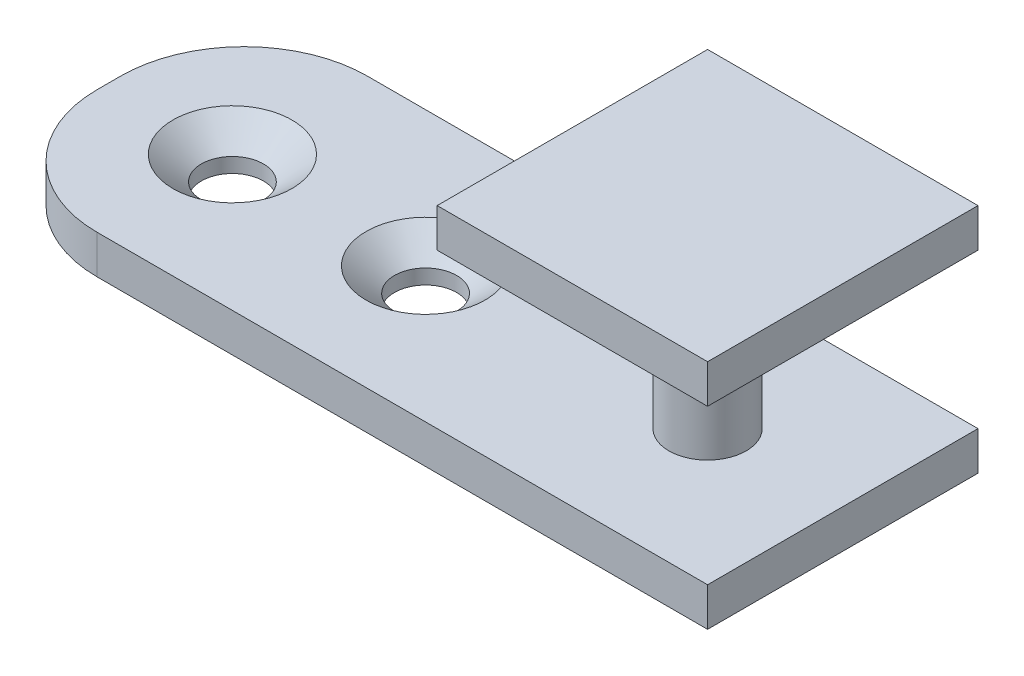
ISO-10303-21;
HEADER;
FILE_DESCRIPTION(('STEP AP214'),'2;1');
FILE_NAME('part.step','',(''),(''),'','','');
FILE_SCHEMA(('AUTOMOTIVE_DESIGN { 1 0 10303 214 1 1 1 1 }'));
ENDSEC;
DATA;
#1=APPLICATION_CONTEXT('core data for automotive mechanical design processes');
#2=APPLICATION_PROTOCOL_DEFINITION('international standard','automotive_design',2000,#1);
#3=PRODUCT_CONTEXT('',#1,'mechanical');
#4=PRODUCT('Part','Part','',(#3));
#5=PRODUCT_RELATED_PRODUCT_CATEGORY('part','',(#4));
#6=PRODUCT_DEFINITION_FORMATION('','',#4);
#7=PRODUCT_DEFINITION_CONTEXT('part definition',#1,'design');
#8=PRODUCT_DEFINITION('design','',#6,#7);
#9=PRODUCT_DEFINITION_SHAPE('','',#8);
#10=(LENGTH_UNIT() NAMED_UNIT(*) SI_UNIT(.MILLI.,.METRE.));
#11=(NAMED_UNIT(*) PLANE_ANGLE_UNIT() SI_UNIT($,.RADIAN.));
#12=(NAMED_UNIT(*) SI_UNIT($,.STERADIAN.) SOLID_ANGLE_UNIT());
#13=UNCERTAINTY_MEASURE_WITH_UNIT(LENGTH_MEASURE(1.E-05),#10,'distance_accuracy_value','');
#14=(GEOMETRIC_REPRESENTATION_CONTEXT(3) GLOBAL_UNCERTAINTY_ASSIGNED_CONTEXT((#13)) GLOBAL_UNIT_ASSIGNED_CONTEXT((#10,
#11,#12)) REPRESENTATION_CONTEXT('',''));
#15=CARTESIAN_POINT('',(0.,0.,0.));
#16=DIRECTION('',(0.,0.,1.));
#17=DIRECTION('',(1.,0.,0.));
#18=AXIS2_PLACEMENT_3D('',#15,#16,#17);
#19=CARTESIAN_POINT('',(0.,12.7,0.));
#20=DIRECTION('',(0.,-1.,0.));
#21=DIRECTION('',(0.,0.,-1.));
#22=AXIS2_PLACEMENT_3D('',#19,#20,#21);
#23=CYLINDRICAL_SURFACE('',#22,3.175);
#24=CARTESIAN_POINT('',(0.,12.7,0.));
#25=DIRECTION('',(0.,1.,0.));
#26=DIRECTION('',(0.,0.,1.));
#27=AXIS2_PLACEMENT_3D('',#24,#25,#26);
#28=CIRCLE('',#27,3.175);
#29=CARTESIAN_POINT('',(0.,12.7,3.175));
#30=VERTEX_POINT('',#29);
#31=EDGE_CURVE('E11',#30,#30,#28,.T.);
#32=ORIENTED_EDGE('',*,*,#31,.F.);
#33=EDGE_LOOP('',(#32));
#34=FACE_BOUND('',#33,.T.);
#35=CARTESIAN_POINT('',(0.,0.,0.));
#36=DIRECTION('',(0.,1.,0.));
#37=DIRECTION('',(0.,0.,1.));
#38=AXIS2_PLACEMENT_3D('',#35,#36,#37);
#39=CIRCLE('',#38,3.175);
#40=CARTESIAN_POINT('',(0.,0.,3.175));
#41=VERTEX_POINT('',#40);
#42=EDGE_CURVE('E36',#41,#41,#39,.T.);
#43=ORIENTED_EDGE('',*,*,#42,.T.);
#44=EDGE_LOOP('',(#43));
#45=FACE_BOUND('',#44,.T.);
#46=ADVANCED_FACE('F33',(#34,#45),#23,.T.);
#47=CARTESIAN_POINT('',(-11.1125,15.875,11.1125));
#48=DIRECTION('',(0.,0.,-1.));
#49=DIRECTION('',(-1.,0.,0.));
#50=AXIS2_PLACEMENT_3D('',#47,#48,#49);
#51=PLANE('',#50);
#52=DIRECTION('',(1.,0.,0.));
#53=VECTOR('',#52,1.);
#54=CARTESIAN_POINT('',(-11.1125,12.7,11.1125));
#55=LINE('',#54,#53);
#56=CARTESIAN_POINT('',(-11.1125,12.7,11.1125));
#57=VERTEX_POINT('',#56);
#58=CARTESIAN_POINT('',(11.1125,12.7,11.1125));
#59=VERTEX_POINT('',#58);
#60=EDGE_CURVE('E185',#57,#59,#55,.T.);
#61=ORIENTED_EDGE('',*,*,#60,.T.);
#62=DIRECTION('',(0.,-1.,0.));
#63=VECTOR('',#62,1.);
#64=CARTESIAN_POINT('',(11.1125,15.875,11.1125));
#65=LINE('',#64,#63);
#66=CARTESIAN_POINT('',(11.1125,15.875,11.1125));
#67=VERTEX_POINT('',#66);
#68=EDGE_CURVE('E42',#67,#59,#65,.T.);
#69=ORIENTED_EDGE('',*,*,#68,.F.);
#70=DIRECTION('',(1.,0.,0.));
#71=VECTOR('',#70,1.);
#72=CARTESIAN_POINT('',(-11.1125,15.875,11.1125));
#73=LINE('',#72,#71);
#74=CARTESIAN_POINT('',(-11.1125,15.875,11.1125));
#75=VERTEX_POINT('',#74);
#76=EDGE_CURVE('E176',#75,#67,#73,.T.);
#77=ORIENTED_EDGE('',*,*,#76,.F.);
#78=DIRECTION('',(0.,-1.,0.));
#79=VECTOR('',#78,1.);
#80=CARTESIAN_POINT('',(-11.1125,15.875,11.1125));
#81=LINE('',#80,#79);
#82=EDGE_CURVE('E50',#75,#57,#81,.T.);
#83=ORIENTED_EDGE('',*,*,#82,.T.);
#84=EDGE_LOOP('',(#61,#69,#77,#83));
#85=FACE_BOUND('',#84,.T.);
#86=ADVANCED_FACE('F201',(#85),#51,.F.);
#87=CARTESIAN_POINT('',(11.1125,15.875,11.1125));
#88=DIRECTION('',(-1.,0.,0.));
#89=DIRECTION('',(0.,0.,1.));
#90=AXIS2_PLACEMENT_3D('',#87,#88,#89);
#91=PLANE('',#90);
#92=DIRECTION('',(0.,0.,-1.));
#93=VECTOR('',#92,1.);
#94=CARTESIAN_POINT('',(11.1125,12.7,11.1125));
#95=LINE('',#94,#93);
#96=CARTESIAN_POINT('',(11.1125,12.7,-11.1125));
#97=VERTEX_POINT('',#96);
#98=EDGE_CURVE('E187',#59,#97,#95,.T.);
#99=ORIENTED_EDGE('',*,*,#98,.T.);
#100=DIRECTION('',(0.,-1.,0.));
#101=VECTOR('',#100,1.);
#102=CARTESIAN_POINT('',(11.1125,15.875,-11.1125));
#103=LINE('',#102,#101);
#104=CARTESIAN_POINT('',(11.1125,15.875,-11.1125));
#105=VERTEX_POINT('',#104);
#106=EDGE_CURVE('E197',#105,#97,#103,.T.);
#107=ORIENTED_EDGE('',*,*,#106,.F.);
#108=DIRECTION('',(0.,0.,-1.));
#109=VECTOR('',#108,1.);
#110=CARTESIAN_POINT('',(11.1125,15.875,11.1125));
#111=LINE('',#110,#109);
#112=EDGE_CURVE('E77',#67,#105,#111,.T.);
#113=ORIENTED_EDGE('',*,*,#112,.F.);
#114=ORIENTED_EDGE('',*,*,#68,.T.);
#115=EDGE_LOOP('',(#99,#107,#113,#114));
#116=FACE_BOUND('',#115,.T.);
#117=ADVANCED_FACE('F200',(#116),#91,.F.);
#118=CARTESIAN_POINT('',(-11.1125,15.875,-11.1125));
#119=DIRECTION('',(0.,0.,-1.));
#120=DIRECTION('',(-1.,0.,0.));
#121=AXIS2_PLACEMENT_3D('',#118,#119,#120);
#122=PLANE('',#121);
#123=DIRECTION('',(1.,0.,0.));
#124=VECTOR('',#123,1.);
#125=CARTESIAN_POINT('',(-11.1125,12.7,-11.1125));
#126=LINE('',#125,#124);
#127=CARTESIAN_POINT('',(-11.1125,12.7,-11.1125));
#128=VERTEX_POINT('',#127);
#129=EDGE_CURVE('E190',#128,#97,#126,.T.);
#130=ORIENTED_EDGE('',*,*,#129,.F.);
#131=DIRECTION('',(0.,-1.,0.));
#132=VECTOR('',#131,1.);
#133=CARTESIAN_POINT('',(-11.1125,15.875,-11.1125));
#134=LINE('',#133,#132);
#135=CARTESIAN_POINT('',(-11.1125,15.875,-11.1125));
#136=VERTEX_POINT('',#135);
#137=EDGE_CURVE('E65',#136,#128,#134,.T.);
#138=ORIENTED_EDGE('',*,*,#137,.F.);
#139=DIRECTION('',(1.,0.,0.));
#140=VECTOR('',#139,1.);
#141=CARTESIAN_POINT('',(-11.1125,15.875,-11.1125));
#142=LINE('',#141,#140);
#143=EDGE_CURVE('E180',#136,#105,#142,.T.);
#144=ORIENTED_EDGE('',*,*,#143,.T.);
#145=ORIENTED_EDGE('',*,*,#106,.T.);
#146=EDGE_LOOP('',(#130,#138,#144,#145));
#147=FACE_BOUND('',#146,.T.);
#148=ADVANCED_FACE('F207',(#147),#122,.T.);
#149=CARTESIAN_POINT('',(-11.1125,15.875,11.1125));
#150=DIRECTION('',(-1.,0.,0.));
#151=DIRECTION('',(0.,0.,1.));
#152=AXIS2_PLACEMENT_3D('',#149,#150,#151);
#153=PLANE('',#152);
#154=DIRECTION('',(0.,0.,-1.));
#155=VECTOR('',#154,1.);
#156=CARTESIAN_POINT('',(-11.1125,12.7,11.1125));
#157=LINE('',#156,#155);
#158=EDGE_CURVE('E178',#57,#128,#157,.T.);
#159=ORIENTED_EDGE('',*,*,#158,.F.);
#160=ORIENTED_EDGE('',*,*,#82,.F.);
#161=DIRECTION('',(0.,0.,-1.));
#162=VECTOR('',#161,1.);
#163=CARTESIAN_POINT('',(-11.1125,15.875,11.1125));
#164=LINE('',#163,#162);
#165=EDGE_CURVE('E183',#75,#136,#164,.T.);
#166=ORIENTED_EDGE('',*,*,#165,.T.);
#167=ORIENTED_EDGE('',*,*,#137,.T.);
#168=EDGE_LOOP('',(#159,#160,#166,#167));
#169=FACE_BOUND('',#168,.T.);
#170=ADVANCED_FACE('F204',(#169),#153,.T.);
#171=CARTESIAN_POINT('',(0.,15.875,0.));
#172=DIRECTION('',(0.,1.,0.));
#173=DIRECTION('',(0.,0.,1.));
#174=AXIS2_PLACEMENT_3D('',#171,#172,#173);
#175=PLANE('',#174);
#176=ORIENTED_EDGE('',*,*,#76,.T.);
#177=ORIENTED_EDGE('',*,*,#112,.T.);
#178=ORIENTED_EDGE('',*,*,#143,.F.);
#179=ORIENTED_EDGE('',*,*,#165,.F.);
#180=EDGE_LOOP('',(#176,#177,#178,#179));
#181=FACE_BOUND('',#180,.T.);
#182=ADVANCED_FACE('F206',(#181),#175,.T.);
#183=CARTESIAN_POINT('',(0.,12.7,0.));
#184=DIRECTION('',(0.,1.,0.));
#185=DIRECTION('',(0.,0.,1.));
#186=AXIS2_PLACEMENT_3D('',#183,#184,#185);
#187=PLANE('',#186);
#188=ORIENTED_EDGE('',*,*,#31,.T.);
#189=EDGE_LOOP('',(#188));
#190=FACE_BOUND('',#189,.T.);
#191=ORIENTED_EDGE('',*,*,#60,.F.);
#192=ORIENTED_EDGE('',*,*,#158,.T.);
#193=ORIENTED_EDGE('',*,*,#129,.T.);
#194=ORIENTED_EDGE('',*,*,#98,.F.);
#195=EDGE_LOOP('',(#191,#192,#193,#194));
#196=FACE_BOUND('',#195,.T.);
#197=ADVANCED_FACE('F203',(#190,#196),#187,.F.);
#198=CARTESIAN_POINT('',(-11.1125,-3.175,11.1125));
#199=DIRECTION('',(0.,0.,1.));
#200=DIRECTION('',(1.,0.,0.));
#201=AXIS2_PLACEMENT_3D('',#198,#199,#200);
#202=PLANE('',#201);
#203=DIRECTION('',(1.,0.,0.));
#204=VECTOR('',#203,1.);
#205=CARTESIAN_POINT('',(-11.1125,0.,11.1125));
#206=LINE('',#205,#204);
#207=CARTESIAN_POINT('',(-39.0525,0.,11.1125));
#208=VERTEX_POINT('',#207);
#209=CARTESIAN_POINT('',(11.1125,0.,11.1125));
#210=VERTEX_POINT('',#209);
#211=EDGE_CURVE('E134',#208,#210,#206,.T.);
#212=ORIENTED_EDGE('',*,*,#211,.F.);
#213=DIRECTION('',(0.,-1.,0.));
#214=VECTOR('',#213,1.);
#215=CARTESIAN_POINT('',(-39.0525,44.1085096665031,11.1125));
#216=LINE('',#215,#214);
#217=CARTESIAN_POINT('',(-39.0525,-3.175,11.1125));
#218=VERTEX_POINT('',#217);
#219=EDGE_CURVE('E131',#208,#218,#216,.T.);
#220=ORIENTED_EDGE('',*,*,#219,.T.);
#221=DIRECTION('',(1.,0.,0.));
#222=VECTOR('',#221,1.);
#223=CARTESIAN_POINT('',(-11.1125,-3.175,11.1125));
#224=LINE('',#223,#222);
#225=CARTESIAN_POINT('',(11.1125,-3.175,11.1125));
#226=VERTEX_POINT('',#225);
#227=EDGE_CURVE('E118',#218,#226,#224,.T.);
#228=ORIENTED_EDGE('',*,*,#227,.T.);
#229=DIRECTION('',(0.,1.,0.));
#230=VECTOR('',#229,1.);
#231=CARTESIAN_POINT('',(11.1125,-3.175,11.1125));
#232=LINE('',#231,#230);
#233=EDGE_CURVE('E166',#226,#210,#232,.T.);
#234=ORIENTED_EDGE('',*,*,#233,.T.);
#235=EDGE_LOOP('',(#212,#220,#228,#234));
#236=FACE_BOUND('',#235,.T.);
#237=ADVANCED_FACE('F132',(#236),#202,.T.);
#238=CARTESIAN_POINT('',(-11.1125,-3.175,-11.1125));
#239=DIRECTION('',(0.,0.,1.));
#240=DIRECTION('',(1.,0.,0.));
#241=AXIS2_PLACEMENT_3D('',#238,#239,#240);
#242=PLANE('',#241);
#243=DIRECTION('',(1.,0.,0.));
#244=VECTOR('',#243,1.);
#245=CARTESIAN_POINT('',(-11.1125,0.,-11.1125));
#246=LINE('',#245,#244);
#247=CARTESIAN_POINT('',(-39.0525,0.,-11.1125));
#248=VERTEX_POINT('',#247);
#249=CARTESIAN_POINT('',(11.1125,0.,-11.1125));
#250=VERTEX_POINT('',#249);
#251=EDGE_CURVE('E168',#248,#250,#246,.T.);
#252=ORIENTED_EDGE('',*,*,#251,.T.);
#253=DIRECTION('',(0.,1.,0.));
#254=VECTOR('',#253,1.);
#255=CARTESIAN_POINT('',(11.1125,-3.175,-11.1125));
#256=LINE('',#255,#254);
#257=CARTESIAN_POINT('',(11.1125,-3.175,-11.1125));
#258=VERTEX_POINT('',#257);
#259=EDGE_CURVE('E174',#258,#250,#256,.T.);
#260=ORIENTED_EDGE('',*,*,#259,.F.);
#261=DIRECTION('',(1.,0.,0.));
#262=VECTOR('',#261,1.);
#263=CARTESIAN_POINT('',(-11.1125,-3.175,-11.1125));
#264=LINE('',#263,#262);
#265=CARTESIAN_POINT('',(-39.0525,-3.175,-11.1125));
#266=VERTEX_POINT('',#265);
#267=EDGE_CURVE('E127',#266,#258,#264,.T.);
#268=ORIENTED_EDGE('',*,*,#267,.F.);
#269=DIRECTION('',(0.,-1.,0.));
#270=VECTOR('',#269,1.);
#271=CARTESIAN_POINT('',(-39.0525,44.1085096665031,-11.1125));
#272=LINE('',#271,#270);
#273=EDGE_CURVE('E157',#248,#266,#272,.T.);
#274=ORIENTED_EDGE('',*,*,#273,.F.);
#275=EDGE_LOOP('',(#252,#260,#268,#274));
#276=FACE_BOUND('',#275,.T.);
#277=ADVANCED_FACE('F240',(#276),#242,.F.);
#278=CARTESIAN_POINT('',(11.1125,-3.175,11.1125));
#279=DIRECTION('',(1.,0.,0.));
#280=DIRECTION('',(0.,0.,-1.));
#281=AXIS2_PLACEMENT_3D('',#278,#279,#280);
#282=PLANE('',#281);
#283=DIRECTION('',(0.,0.,-1.));
#284=VECTOR('',#283,1.);
#285=CARTESIAN_POINT('',(11.1125,0.,11.1125));
#286=LINE('',#285,#284);
#287=EDGE_CURVE('E128',#210,#250,#286,.T.);
#288=ORIENTED_EDGE('',*,*,#287,.F.);
#289=ORIENTED_EDGE('',*,*,#233,.F.);
#290=DIRECTION('',(0.,0.,-1.));
#291=VECTOR('',#290,1.);
#292=CARTESIAN_POINT('',(11.1125,-3.175,11.1125));
#293=LINE('',#292,#291);
#294=EDGE_CURVE('E125',#226,#258,#293,.T.);
#295=ORIENTED_EDGE('',*,*,#294,.T.);
#296=ORIENTED_EDGE('',*,*,#259,.T.);
#297=EDGE_LOOP('',(#288,#289,#295,#296));
#298=FACE_BOUND('',#297,.T.);
#299=ADVANCED_FACE('F236',(#298),#282,.T.);
#300=CARTESIAN_POINT('',(0.,-3.175,0.));
#301=DIRECTION('',(0.,-1.,0.));
#302=DIRECTION('',(0.,0.,1.));
#303=AXIS2_PLACEMENT_3D('',#300,#301,#302);
#304=PLANE('',#303);
#305=CARTESIAN_POINT('',(-39.0525,-3.175,0.));
#306=DIRECTION('',(0.,1.,0.));
#307=DIRECTION('',(0.,0.,1.));
#308=AXIS2_PLACEMENT_3D('',#305,#306,#307);
#309=CIRCLE('',#308,2.5527);
#310=CARTESIAN_POINT('',(-39.0525,-3.175,2.5527));
#311=VERTEX_POINT('',#310);
#312=EDGE_CURVE('E254',#311,#311,#309,.T.);
#313=ORIENTED_EDGE('',*,*,#312,.T.);
#314=EDGE_LOOP('',(#313));
#315=FACE_BOUND('',#314,.T.);
#316=CARTESIAN_POINT('',(-23.1775,-3.175,0.));
#317=DIRECTION('',(0.,1.,0.));
#318=DIRECTION('',(0.,0.,1.));
#319=AXIS2_PLACEMENT_3D('',#316,#317,#318);
#320=CIRCLE('',#319,2.5527);
#321=CARTESIAN_POINT('',(-23.1775,-3.175,2.5527));
#322=VERTEX_POINT('',#321);
#323=EDGE_CURVE('E145',#322,#322,#320,.T.);
#324=ORIENTED_EDGE('',*,*,#323,.T.);
#325=EDGE_LOOP('',(#324));
#326=FACE_BOUND('',#325,.T.);
#327=ORIENTED_EDGE('',*,*,#227,.F.);
#328=CARTESIAN_POINT('',(-39.0525,-3.175,0.952499999999997));
#329=DIRECTION('',(0.,-1.,0.));
#330=DIRECTION('',(0.,0.,1.));
#331=AXIS2_PLACEMENT_3D('',#328,#329,#330);
#332=CIRCLE('',#331,10.16);
#333=CARTESIAN_POINT('',(-49.2125,-3.175,0.952499999999997));
#334=VERTEX_POINT('',#333);
#335=EDGE_CURVE('E123',#218,#334,#332,.T.);
#336=ORIENTED_EDGE('',*,*,#335,.T.);
#337=DIRECTION('',(0.,0.,-1.));
#338=VECTOR('',#337,1.);
#339=CARTESIAN_POINT('',(-49.2125,-3.175,-0.9525));
#340=LINE('',#339,#338);
#341=CARTESIAN_POINT('',(-49.2125,-3.175,-0.952499999999998));
#342=VERTEX_POINT('',#341);
#343=EDGE_CURVE('E144',#334,#342,#340,.T.);
#344=ORIENTED_EDGE('',*,*,#343,.T.);
#345=CARTESIAN_POINT('',(-39.0525,-3.175,-0.9525));
#346=DIRECTION('',(0.,-1.,0.));
#347=DIRECTION('',(0.,0.,-1.));
#348=AXIS2_PLACEMENT_3D('',#345,#346,#347);
#349=CIRCLE('',#348,10.16);
#350=EDGE_CURVE('E139',#342,#266,#349,.T.);
#351=ORIENTED_EDGE('',*,*,#350,.T.);
#352=ORIENTED_EDGE('',*,*,#267,.T.);
#353=ORIENTED_EDGE('',*,*,#294,.F.);
#354=EDGE_LOOP('',(#327,#336,#344,#351,#352,#353));
#355=FACE_BOUND('',#354,.T.);
#356=ADVANCED_FACE('F120',(#315,#326,#355),#304,.T.);
#357=CARTESIAN_POINT('',(0.,0.,0.));
#358=DIRECTION('',(0.,-1.,0.));
#359=DIRECTION('',(0.,0.,1.));
#360=AXIS2_PLACEMENT_3D('',#357,#358,#359);
#361=PLANE('',#360);
#362=CARTESIAN_POINT('',(-39.0525,0.,0.));
#363=DIRECTION('',(0.,1.,0.));
#364=DIRECTION('',(0.,0.,1.));
#365=AXIS2_PLACEMENT_3D('',#362,#363,#364);
#366=CIRCLE('',#365,4.8895);
#367=CARTESIAN_POINT('',(-39.0525,0.,4.8895));
#368=VERTEX_POINT('',#367);
#369=EDGE_CURVE('E260',#368,#368,#366,.T.);
#370=ORIENTED_EDGE('',*,*,#369,.F.);
#371=EDGE_LOOP('',(#370));
#372=FACE_BOUND('',#371,.T.);
#373=CARTESIAN_POINT('',(-23.1775,0.,0.));
#374=DIRECTION('',(0.,1.,0.));
#375=DIRECTION('',(0.,0.,1.));
#376=AXIS2_PLACEMENT_3D('',#373,#374,#375);
#377=CIRCLE('',#376,4.8895);
#378=CARTESIAN_POINT('',(-23.1775,0.,4.8895));
#379=VERTEX_POINT('',#378);
#380=EDGE_CURVE('E251',#379,#379,#377,.T.);
#381=ORIENTED_EDGE('',*,*,#380,.F.);
#382=EDGE_LOOP('',(#381));
#383=FACE_BOUND('',#382,.T.);
#384=ORIENTED_EDGE('',*,*,#42,.F.);
#385=EDGE_LOOP('',(#384));
#386=FACE_BOUND('',#385,.T.);
#387=ORIENTED_EDGE('',*,*,#211,.T.);
#388=ORIENTED_EDGE('',*,*,#287,.T.);
#389=ORIENTED_EDGE('',*,*,#251,.F.);
#390=CARTESIAN_POINT('',(-39.0525,0.,-0.9525));
#391=DIRECTION('',(0.,-1.,0.));
#392=DIRECTION('',(0.,0.,-1.));
#393=AXIS2_PLACEMENT_3D('',#390,#391,#392);
#394=CIRCLE('',#393,10.16);
#395=CARTESIAN_POINT('',(-49.2125,0.,-0.952499999999998));
#396=VERTEX_POINT('',#395);
#397=EDGE_CURVE('E152',#248,#396,#394,.F.);
#398=ORIENTED_EDGE('',*,*,#397,.T.);
#399=DIRECTION('',(0.,0.,1.));
#400=VECTOR('',#399,1.);
#401=CARTESIAN_POINT('',(-49.2125,0.,-0.9525));
#402=LINE('',#401,#400);
#403=CARTESIAN_POINT('',(-49.2125,0.,0.952499999999997));
#404=VERTEX_POINT('',#403);
#405=EDGE_CURVE('E246',#396,#404,#402,.T.);
#406=ORIENTED_EDGE('',*,*,#405,.T.);
#407=CARTESIAN_POINT('',(-39.0525,0.,0.952499999999997));
#408=DIRECTION('',(0.,-1.,0.));
#409=DIRECTION('',(0.,0.,-1.));
#410=AXIS2_PLACEMENT_3D('',#407,#408,#409);
#411=CIRCLE('',#410,10.16);
#412=EDGE_CURVE('E160',#404,#208,#411,.F.);
#413=ORIENTED_EDGE('',*,*,#412,.T.);
#414=EDGE_LOOP('',(#387,#388,#389,#398,#406,#413));
#415=FACE_BOUND('',#414,.T.);
#416=ADVANCED_FACE('F228',(#372,#383,#386,#415),#361,.F.);
#417=CARTESIAN_POINT('',(-39.0525,44.1085096665031,-0.9525));
#418=DIRECTION('',(0.,-1.,0.));
#419=DIRECTION('',(0.,0.,-1.));
#420=AXIS2_PLACEMENT_3D('',#417,#418,#419);
#421=CYLINDRICAL_SURFACE('',#420,10.16);
#422=ORIENTED_EDGE('',*,*,#397,.F.);
#423=ORIENTED_EDGE('',*,*,#273,.T.);
#424=ORIENTED_EDGE('',*,*,#350,.F.);
#425=DIRECTION('',(0.,-1.,0.));
#426=VECTOR('',#425,1.);
#427=CARTESIAN_POINT('',(-49.2125,44.1085096665031,-0.952499999999998));
#428=LINE('',#427,#426);
#429=EDGE_CURVE('E161',#396,#342,#428,.T.);
#430=ORIENTED_EDGE('',*,*,#429,.F.);
#431=EDGE_LOOP('',(#422,#423,#424,#430));
#432=FACE_BOUND('',#431,.T.);
#433=ADVANCED_FACE('F231',(#432),#421,.T.);
#434=CARTESIAN_POINT('',(-49.2125,44.1085096665031,-0.9525));
#435=DIRECTION('',(-1.,0.,0.));
#436=DIRECTION('',(0.,0.,1.));
#437=AXIS2_PLACEMENT_3D('',#434,#435,#436);
#438=PLANE('',#437);
#439=ORIENTED_EDGE('',*,*,#405,.F.);
#440=ORIENTED_EDGE('',*,*,#429,.T.);
#441=ORIENTED_EDGE('',*,*,#343,.F.);
#442=DIRECTION('',(0.,-1.,0.));
#443=VECTOR('',#442,1.);
#444=CARTESIAN_POINT('',(-49.2125,44.1085096665031,0.952499999999997));
#445=LINE('',#444,#443);
#446=EDGE_CURVE('E138',#404,#334,#445,.T.);
#447=ORIENTED_EDGE('',*,*,#446,.F.);
#448=EDGE_LOOP('',(#439,#440,#441,#447));
#449=FACE_BOUND('',#448,.T.);
#450=ADVANCED_FACE('F287',(#449),#438,.T.);
#451=CARTESIAN_POINT('',(-39.0525,44.1085096665031,0.952499999999997));
#452=DIRECTION('',(0.,-1.,0.));
#453=DIRECTION('',(0.,0.,-1.));
#454=AXIS2_PLACEMENT_3D('',#451,#452,#453);
#455=CYLINDRICAL_SURFACE('',#454,10.16);
#456=ORIENTED_EDGE('',*,*,#412,.F.);
#457=ORIENTED_EDGE('',*,*,#446,.T.);
#458=ORIENTED_EDGE('',*,*,#335,.F.);
#459=ORIENTED_EDGE('',*,*,#219,.F.);
#460=EDGE_LOOP('',(#456,#457,#458,#459));
#461=FACE_BOUND('',#460,.T.);
#462=ADVANCED_FACE('F141',(#461),#455,.T.);
#463=CARTESIAN_POINT('',(-23.1775,0.,0.));
#464=DIRECTION('',(0.,1.,0.));
#465=DIRECTION('',(0.,0.,1.));
#466=AXIS2_PLACEMENT_3D('',#463,#464,#465);
#467=CYLINDRICAL_SURFACE('',#466,2.5527);
#468=ORIENTED_EDGE('',*,*,#323,.F.);
#469=EDGE_LOOP('',(#468));
#470=FACE_BOUND('',#469,.T.);
#471=CARTESIAN_POINT('',(-23.1775,-1.96080801813507,0.));
#472=DIRECTION('',(0.,1.,0.));
#473=DIRECTION('',(0.,0.,1.));
#474=AXIS2_PLACEMENT_3D('',#471,#472,#473);
#475=CIRCLE('',#474,2.5527);
#476=CARTESIAN_POINT('',(-23.1775,-1.96080801813507,2.5527));
#477=VERTEX_POINT('',#476);
#478=EDGE_CURVE('E149',#477,#477,#475,.T.);
#479=ORIENTED_EDGE('',*,*,#478,.T.);
#480=EDGE_LOOP('',(#479));
#481=FACE_BOUND('',#480,.T.);
#482=ADVANCED_FACE('F271',(#470,#481),#467,.F.);
#483=CARTESIAN_POINT('',(-23.1775,0.,0.));
#484=DIRECTION('',(0.,1.,0.));
#485=DIRECTION('',(0.,0.,1.));
#486=AXIS2_PLACEMENT_3D('',#483,#484,#485);
#487=CONICAL_SURFACE('',#486,4.8895,0.872664625997164);
#488=ORIENTED_EDGE('',*,*,#478,.F.);
#489=EDGE_LOOP('',(#488));
#490=FACE_BOUND('',#489,.T.);
#491=ORIENTED_EDGE('',*,*,#380,.T.);
#492=EDGE_LOOP('',(#491));
#493=FACE_BOUND('',#492,.T.);
#494=ADVANCED_FACE('F268',(#490,#493),#487,.F.);
#495=CARTESIAN_POINT('',(-39.0525,0.,0.));
#496=DIRECTION('',(0.,1.,0.));
#497=DIRECTION('',(0.,0.,1.));
#498=AXIS2_PLACEMENT_3D('',#495,#496,#497);
#499=CYLINDRICAL_SURFACE('',#498,2.5527);
#500=ORIENTED_EDGE('',*,*,#312,.F.);
#501=EDGE_LOOP('',(#500));
#502=FACE_BOUND('',#501,.T.);
#503=CARTESIAN_POINT('',(-39.0525,-1.96080801813507,0.));
#504=DIRECTION('',(0.,1.,0.));
#505=DIRECTION('',(0.,0.,1.));
#506=AXIS2_PLACEMENT_3D('',#503,#504,#505);
#507=CIRCLE('',#506,2.5527);
#508=CARTESIAN_POINT('',(-39.0525,-1.96080801813507,2.5527));
#509=VERTEX_POINT('',#508);
#510=EDGE_CURVE('E257',#509,#509,#507,.T.);
#511=ORIENTED_EDGE('',*,*,#510,.T.);
#512=EDGE_LOOP('',(#511));
#513=FACE_BOUND('',#512,.T.);
#514=ADVANCED_FACE('F270',(#502,#513),#499,.F.);
#515=CARTESIAN_POINT('',(-39.0525,0.,0.));
#516=DIRECTION('',(0.,1.,0.));
#517=DIRECTION('',(0.,0.,1.));
#518=AXIS2_PLACEMENT_3D('',#515,#516,#517);
#519=CONICAL_SURFACE('',#518,4.8895,0.872664625997165);
#520=ORIENTED_EDGE('',*,*,#510,.F.);
#521=EDGE_LOOP('',(#520));
#522=FACE_BOUND('',#521,.T.);
#523=ORIENTED_EDGE('',*,*,#369,.T.);
#524=EDGE_LOOP('',(#523));
#525=FACE_BOUND('',#524,.T.);
#526=ADVANCED_FACE('F264',(#522,#525),#519,.F.);
#527=CLOSED_SHELL('',(#46,#86,#117,#148,#170,#182,#197,#237,#277,#299,#356,#416,#433,#450,#462,
#482,#494,#514,#526));
#528=MANIFOLD_SOLID_BREP('B2',#527);
#529=ADVANCED_BREP_SHAPE_REPRESENTATION('',(#18,#528),#14);
#530=SHAPE_DEFINITION_REPRESENTATION(#9,#529);
ENDSEC;
END-ISO-10303-21;
